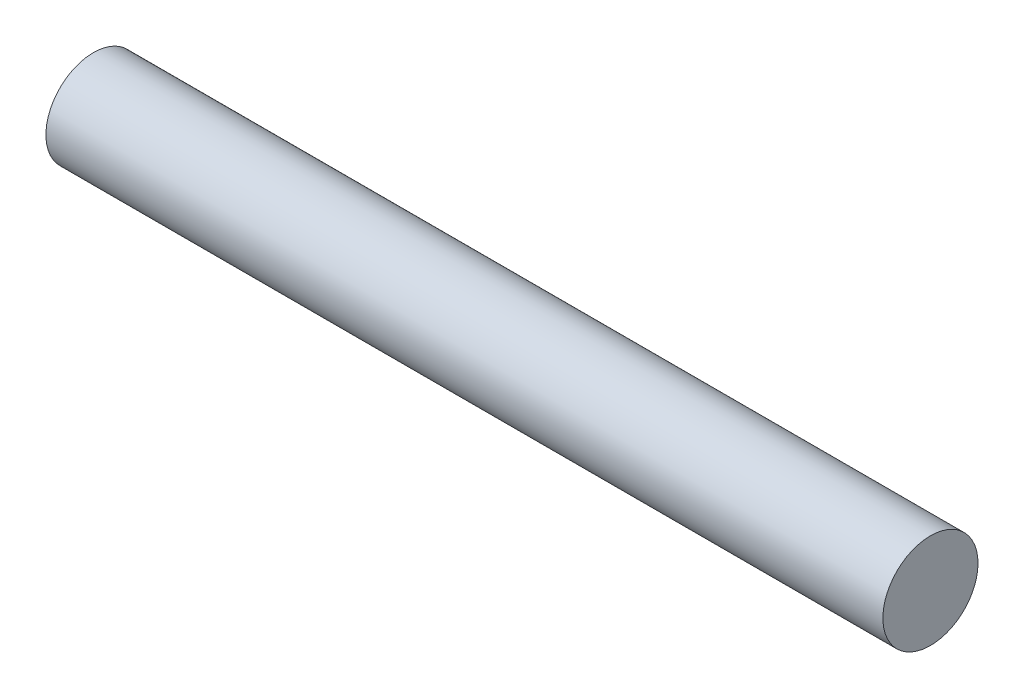
ISO-10303-21;
HEADER;
FILE_DESCRIPTION(('STEP AP214'),'2;1');
FILE_NAME('part.step','',(''),(''),'','','');
FILE_SCHEMA(('AUTOMOTIVE_DESIGN { 1 0 10303 214 1 1 1 1 }'));
ENDSEC;
DATA;
#1=APPLICATION_CONTEXT('core data for automotive mechanical design processes');
#2=APPLICATION_PROTOCOL_DEFINITION('international standard','automotive_design',2000,#1);
#3=PRODUCT_CONTEXT('',#1,'mechanical');
#4=PRODUCT('Part','Part','',(#3));
#5=PRODUCT_RELATED_PRODUCT_CATEGORY('part','',(#4));
#6=PRODUCT_DEFINITION_FORMATION('','',#4);
#7=PRODUCT_DEFINITION_CONTEXT('part definition',#1,'design');
#8=PRODUCT_DEFINITION('design','',#6,#7);
#9=PRODUCT_DEFINITION_SHAPE('','',#8);
#10=(LENGTH_UNIT() NAMED_UNIT(*) SI_UNIT(.MILLI.,.METRE.));
#11=(NAMED_UNIT(*) PLANE_ANGLE_UNIT() SI_UNIT($,.RADIAN.));
#12=(NAMED_UNIT(*) SI_UNIT($,.STERADIAN.) SOLID_ANGLE_UNIT());
#13=UNCERTAINTY_MEASURE_WITH_UNIT(LENGTH_MEASURE(1.E-05),#10,'distance_accuracy_value','');
#14=(GEOMETRIC_REPRESENTATION_CONTEXT(3) GLOBAL_UNCERTAINTY_ASSIGNED_CONTEXT((#13)) GLOBAL_UNIT_ASSIGNED_CONTEXT((#10,
#11,#12)) REPRESENTATION_CONTEXT('',''));
#15=CARTESIAN_POINT('',(0.,0.,0.));
#16=DIRECTION('',(0.,0.,1.));
#17=DIRECTION('',(1.,0.,0.));
#18=AXIS2_PLACEMENT_3D('',#15,#16,#17);
#19=CARTESIAN_POINT('',(0.,0.,0.));
#20=DIRECTION('',(-1.,0.,0.));
#21=DIRECTION('',(0.,0.,1.));
#22=AXIS2_PLACEMENT_3D('',#19,#20,#21);
#23=PLANE('',#22);
#24=CARTESIAN_POINT('',(0.,0.,0.));
#25=DIRECTION('',(1.,0.,0.));
#26=DIRECTION('',(0.,0.,-1.));
#27=AXIS2_PLACEMENT_3D('',#24,#25,#26);
#28=CIRCLE('',#27,7.5);
#29=CARTESIAN_POINT('',(0.,0.,-7.5));
#30=VERTEX_POINT('',#29);
#31=EDGE_CURVE('E10',#30,#30,#28,.T.);
#32=ORIENTED_EDGE('',*,*,#31,.F.);
#33=EDGE_LOOP('',(#32));
#34=FACE_BOUND('',#33,.T.);
#35=ADVANCED_FACE('F31',(#34),#23,.T.);
#36=CARTESIAN_POINT('',(0.,0.,0.));
#37=DIRECTION('',(1.,0.,0.));
#38=DIRECTION('',(0.,0.,-1.));
#39=AXIS2_PLACEMENT_3D('',#36,#37,#38);
#40=CYLINDRICAL_SURFACE('',#39,7.5);
#41=ORIENTED_EDGE('',*,*,#31,.T.);
#42=EDGE_LOOP('',(#41));
#43=FACE_BOUND('',#42,.T.);
#44=CARTESIAN_POINT('',(132.,0.,0.));
#45=DIRECTION('',(1.,0.,0.));
#46=DIRECTION('',(0.,0.,-1.));
#47=AXIS2_PLACEMENT_3D('',#44,#45,#46);
#48=CIRCLE('',#47,7.5);
#49=CARTESIAN_POINT('',(132.,0.,-7.5));
#50=VERTEX_POINT('',#49);
#51=EDGE_CURVE('E37',#50,#50,#48,.T.);
#52=ORIENTED_EDGE('',*,*,#51,.F.);
#53=EDGE_LOOP('',(#52));
#54=FACE_BOUND('',#53,.T.);
#55=ADVANCED_FACE('F45',(#43,#54),#40,.T.);
#56=CARTESIAN_POINT('',(132.,7.5,0.));
#57=DIRECTION('',(1.,0.,0.));
#58=DIRECTION('',(0.,0.,-1.));
#59=AXIS2_PLACEMENT_3D('',#56,#57,#58);
#60=PLANE('',#59);
#61=ORIENTED_EDGE('',*,*,#51,.T.);
#62=EDGE_LOOP('',(#61));
#63=FACE_BOUND('',#62,.T.);
#64=ADVANCED_FACE('F43',(#63),#60,.T.);
#65=CLOSED_SHELL('',(#35,#55,#64));
#66=MANIFOLD_SOLID_BREP('B2',#65);
#67=ADVANCED_BREP_SHAPE_REPRESENTATION('',(#18,#66),#14);
#68=SHAPE_DEFINITION_REPRESENTATION(#9,#67);
ENDSEC;
END-ISO-10303-21;
